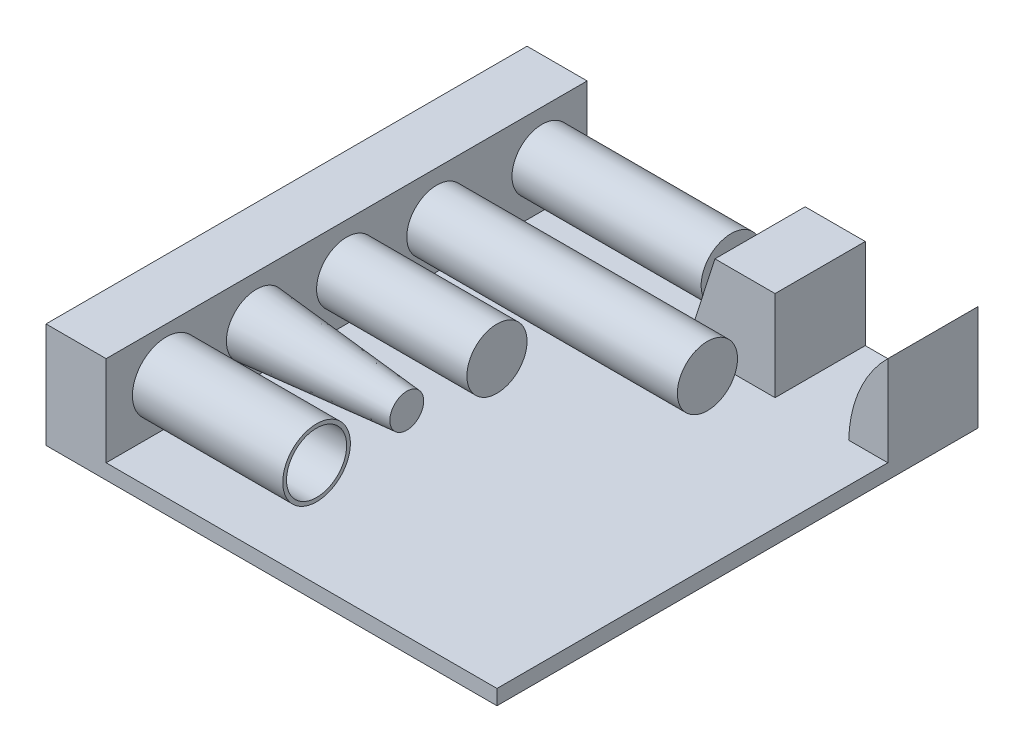
ISO-10303-21;
HEADER;
FILE_DESCRIPTION(('STEP AP214'),'2;1');
FILE_NAME('part.step','',(''),(''),'','','');
FILE_SCHEMA(('AUTOMOTIVE_DESIGN { 1 0 10303 214 1 1 1 1 }'));
ENDSEC;
DATA;
#1=APPLICATION_CONTEXT('core data for automotive mechanical design processes');
#2=APPLICATION_PROTOCOL_DEFINITION('international standard','automotive_design',2000,#1);
#3=PRODUCT_CONTEXT('',#1,'mechanical');
#4=PRODUCT('Part','Part','',(#3));
#5=PRODUCT_RELATED_PRODUCT_CATEGORY('part','',(#4));
#6=PRODUCT_DEFINITION_FORMATION('','',#4);
#7=PRODUCT_DEFINITION_CONTEXT('part definition',#1,'design');
#8=PRODUCT_DEFINITION('design','',#6,#7);
#9=PRODUCT_DEFINITION_SHAPE('','',#8);
#10=(LENGTH_UNIT() NAMED_UNIT(*) SI_UNIT(.MILLI.,.METRE.));
#11=(NAMED_UNIT(*) PLANE_ANGLE_UNIT() SI_UNIT($,.RADIAN.));
#12=(NAMED_UNIT(*) SI_UNIT($,.STERADIAN.) SOLID_ANGLE_UNIT());
#13=UNCERTAINTY_MEASURE_WITH_UNIT(LENGTH_MEASURE(1.E-05),#10,'distance_accuracy_value','');
#14=(GEOMETRIC_REPRESENTATION_CONTEXT(3) GLOBAL_UNCERTAINTY_ASSIGNED_CONTEXT((#13)) GLOBAL_UNIT_ASSIGNED_CONTEXT((#10,
#11,#12)) REPRESENTATION_CONTEXT('',''));
#15=CARTESIAN_POINT('',(0.,0.,0.));
#16=DIRECTION('',(0.,0.,1.));
#17=DIRECTION('',(1.,0.,0.));
#18=AXIS2_PLACEMENT_3D('',#15,#16,#17);
#19=CARTESIAN_POINT('',(-220.,20.,640.));
#20=DIRECTION('',(0.,-1.,0.));
#21=DIRECTION('',(0.,0.,-1.));
#22=AXIS2_PLACEMENT_3D('',#19,#20,#21);
#23=PLANE('',#22);
#24=DIRECTION('',(0.,0.,-1.));
#25=VECTOR('',#24,1.);
#26=CARTESIAN_POINT('',(31.6,20.,120.));
#27=LINE('',#26,#25);
#28=CARTESIAN_POINT('',(31.6,20.,120.));
#29=VERTEX_POINT('',#28);
#30=CARTESIAN_POINT('',(31.6,20.,0.));
#31=VERTEX_POINT('',#30);
#32=EDGE_CURVE('E174',#29,#31,#27,.T.);
#33=ORIENTED_EDGE('',*,*,#32,.T.);
#34=DIRECTION('',(-1.,0.,0.));
#35=VECTOR('',#34,1.);
#36=CARTESIAN_POINT('',(-220.,20.,0.));
#37=LINE('',#36,#35);
#38=CARTESIAN_POINT('',(-220.,20.,0.));
#39=VERTEX_POINT('',#38);
#40=EDGE_CURVE('E231',#31,#39,#37,.T.);
#41=ORIENTED_EDGE('',*,*,#40,.T.);
#42=DIRECTION('',(0.,0.,-1.));
#43=VECTOR('',#42,1.);
#44=CARTESIAN_POINT('',(-220.,20.,640.));
#45=LINE('',#44,#43);
#46=CARTESIAN_POINT('',(-220.,20.,640.));
#47=VERTEX_POINT('',#46);
#48=EDGE_CURVE('E247',#47,#39,#45,.T.);
#49=ORIENTED_EDGE('',*,*,#48,.F.);
#50=DIRECTION('',(-1.,0.,0.));
#51=VECTOR('',#50,1.);
#52=CARTESIAN_POINT('',(-220.,20.,640.));
#53=LINE('',#52,#51);
#54=CARTESIAN_POINT('',(300.,20.,640.));
#55=VERTEX_POINT('',#54);
#56=EDGE_CURVE('E212',#55,#47,#53,.T.);
#57=ORIENTED_EDGE('',*,*,#56,.F.);
#58=DIRECTION('',(0.,0.,-1.));
#59=VECTOR('',#58,1.);
#60=CARTESIAN_POINT('',(300.,20.,640.));
#61=LINE('',#60,#59);
#62=CARTESIAN_POINT('',(300.,20.,120.));
#63=VERTEX_POINT('',#62);
#64=EDGE_CURVE('E251',#55,#63,#61,.T.);
#65=ORIENTED_EDGE('',*,*,#64,.T.);
#66=DIRECTION('',(1.,0.,0.));
#67=VECTOR('',#66,1.);
#68=CARTESIAN_POINT('',(300.,20.,120.));
#69=LINE('',#68,#67);
#70=CARTESIAN_POINT('',(247.956312481218,20.,120.));
#71=VERTEX_POINT('',#70);
#72=EDGE_CURVE('E178',#71,#63,#69,.T.);
#73=ORIENTED_EDGE('',*,*,#72,.F.);
#74=DIRECTION('',(0.,0.,-1.));
#75=VECTOR('',#74,1.);
#76=CARTESIAN_POINT('',(247.956312481219,20.,120.));
#77=LINE('',#76,#75);
#78=CARTESIAN_POINT('',(247.956312481219,20.,0.));
#79=VERTEX_POINT('',#78);
#80=EDGE_CURVE('E189',#71,#79,#77,.T.);
#81=ORIENTED_EDGE('',*,*,#80,.T.);
#82=CARTESIAN_POINT('',(150.,20.,0.));
#83=VERTEX_POINT('',#82);
#84=EDGE_CURVE('E232',#79,#83,#37,.T.);
#85=ORIENTED_EDGE('',*,*,#84,.T.);
#86=DIRECTION('',(0.,0.,-1.));
#87=VECTOR('',#86,1.);
#88=CARTESIAN_POINT('',(150.,20.,120.));
#89=LINE('',#88,#87);
#90=CARTESIAN_POINT('',(150.,20.,120.));
#91=VERTEX_POINT('',#90);
#92=EDGE_CURVE('E66',#91,#83,#89,.T.);
#93=ORIENTED_EDGE('',*,*,#92,.F.);
#94=DIRECTION('',(1.,0.,0.));
#95=VECTOR('',#94,1.);
#96=CARTESIAN_POINT('',(150.,20.,120.));
#97=LINE('',#96,#95);
#98=EDGE_CURVE('E61',#29,#91,#97,.T.);
#99=ORIENTED_EDGE('',*,*,#98,.F.);
#100=EDGE_LOOP('',(#33,#41,#49,#57,#65,#73,#81,#85,#93,#99));
#101=FACE_BOUND('',#100,.T.);
#102=ADVANCED_FACE('F45',(#101),#23,.F.);
#103=CARTESIAN_POINT('',(-300.,0.,640.));
#104=DIRECTION('',(1.,0.,0.));
#105=DIRECTION('',(0.,0.,-1.));
#106=AXIS2_PLACEMENT_3D('',#103,#104,#105);
#107=PLANE('',#106);
#108=DIRECTION('',(0.,-1.,0.));
#109=VECTOR('',#108,1.);
#110=CARTESIAN_POINT('',(-300.,0.,0.));
#111=LINE('',#110,#109);
#112=CARTESIAN_POINT('',(-300.,140.,0.));
#113=VERTEX_POINT('',#112);
#114=CARTESIAN_POINT('',(-300.,0.,0.));
#115=VERTEX_POINT('',#114);
#116=EDGE_CURVE('E200',#113,#115,#111,.T.);
#117=ORIENTED_EDGE('',*,*,#116,.T.);
#118=DIRECTION('',(0.,0.,-1.));
#119=VECTOR('',#118,1.);
#120=CARTESIAN_POINT('',(-300.,0.,640.));
#121=LINE('',#120,#119);
#122=CARTESIAN_POINT('',(-300.,0.,640.));
#123=VERTEX_POINT('',#122);
#124=EDGE_CURVE('E258',#123,#115,#121,.T.);
#125=ORIENTED_EDGE('',*,*,#124,.F.);
#126=DIRECTION('',(0.,-1.,0.));
#127=VECTOR('',#126,1.);
#128=CARTESIAN_POINT('',(-300.,0.,640.));
#129=LINE('',#128,#127);
#130=CARTESIAN_POINT('',(-300.,140.,640.));
#131=VERTEX_POINT('',#130);
#132=EDGE_CURVE('E201',#131,#123,#129,.T.);
#133=ORIENTED_EDGE('',*,*,#132,.F.);
#134=DIRECTION('',(0.,0.,-1.));
#135=VECTOR('',#134,1.);
#136=CARTESIAN_POINT('',(-300.,140.,640.));
#137=LINE('',#136,#135);
#138=EDGE_CURVE('E221',#131,#113,#137,.T.);
#139=ORIENTED_EDGE('',*,*,#138,.T.);
#140=EDGE_LOOP('',(#117,#125,#133,#139));
#141=FACE_BOUND('',#140,.T.);
#142=ADVANCED_FACE('F47',(#141),#107,.F.);
#143=CARTESIAN_POINT('',(-300.,0.,640.));
#144=DIRECTION('',(0.,1.,0.));
#145=DIRECTION('',(0.,0.,1.));
#146=AXIS2_PLACEMENT_3D('',#143,#144,#145);
#147=PLANE('',#146);
#148=DIRECTION('',(1.,0.,0.));
#149=VECTOR('',#148,1.);
#150=CARTESIAN_POINT('',(-300.,0.,0.));
#151=LINE('',#150,#149);
#152=CARTESIAN_POINT('',(300.,0.,0.));
#153=VERTEX_POINT('',#152);
#154=EDGE_CURVE('E225',#115,#153,#151,.T.);
#155=ORIENTED_EDGE('',*,*,#154,.T.);
#156=DIRECTION('',(0.,0.,-1.));
#157=VECTOR('',#156,1.);
#158=CARTESIAN_POINT('',(300.,0.,640.));
#159=LINE('',#158,#157);
#160=CARTESIAN_POINT('',(300.,0.,640.));
#161=VERTEX_POINT('',#160);
#162=EDGE_CURVE('E254',#161,#153,#159,.T.);
#163=ORIENTED_EDGE('',*,*,#162,.F.);
#164=DIRECTION('',(1.,0.,0.));
#165=VECTOR('',#164,1.);
#166=CARTESIAN_POINT('',(-300.,0.,640.));
#167=LINE('',#166,#165);
#168=EDGE_CURVE('E205',#123,#161,#167,.T.);
#169=ORIENTED_EDGE('',*,*,#168,.F.);
#170=ORIENTED_EDGE('',*,*,#124,.T.);
#171=EDGE_LOOP('',(#155,#163,#169,#170));
#172=FACE_BOUND('',#171,.T.);
#173=ADVANCED_FACE('F374',(#172),#147,.F.);
#174=CARTESIAN_POINT('',(300.,20.,640.));
#175=DIRECTION('',(-1.,0.,0.));
#176=DIRECTION('',(0.,0.,1.));
#177=AXIS2_PLACEMENT_3D('',#174,#175,#176);
#178=PLANE('',#177);
#179=DIRECTION('',(0.,1.,0.));
#180=VECTOR('',#179,1.);
#181=CARTESIAN_POINT('',(300.,20.,0.));
#182=LINE('',#181,#180);
#183=CARTESIAN_POINT('',(300.,140.,0.));
#184=VERTEX_POINT('',#183);
#185=EDGE_CURVE('E228',#153,#184,#182,.T.);
#186=ORIENTED_EDGE('',*,*,#185,.T.);
#187=DIRECTION('',(0.,0.,-1.));
#188=VECTOR('',#187,1.);
#189=CARTESIAN_POINT('',(300.,140.,120.));
#190=LINE('',#189,#188);
#191=CARTESIAN_POINT('',(300.,140.,120.));
#192=VERTEX_POINT('',#191);
#193=EDGE_CURVE('E196',#192,#184,#190,.T.);
#194=ORIENTED_EDGE('',*,*,#193,.F.);
#195=DIRECTION('',(0.,1.,0.));
#196=VECTOR('',#195,1.);
#197=CARTESIAN_POINT('',(300.,140.,120.));
#198=LINE('',#197,#196);
#199=EDGE_CURVE('E182',#63,#192,#198,.T.);
#200=ORIENTED_EDGE('',*,*,#199,.F.);
#201=ORIENTED_EDGE('',*,*,#64,.F.);
#202=DIRECTION('',(0.,1.,0.));
#203=VECTOR('',#202,1.);
#204=CARTESIAN_POINT('',(300.,20.,640.));
#205=LINE('',#204,#203);
#206=EDGE_CURVE('E209',#161,#55,#205,.T.);
#207=ORIENTED_EDGE('',*,*,#206,.F.);
#208=ORIENTED_EDGE('',*,*,#162,.T.);
#209=EDGE_LOOP('',(#186,#194,#200,#201,#207,#208));
#210=FACE_BOUND('',#209,.T.);
#211=ADVANCED_FACE('F279',(#210),#178,.F.);
#212=CARTESIAN_POINT('',(-220.,140.,640.));
#213=DIRECTION('',(-1.,0.,0.));
#214=DIRECTION('',(0.,0.,1.));
#215=AXIS2_PLACEMENT_3D('',#212,#213,#214);
#216=PLANE('',#215);
#217=CARTESIAN_POINT('',(-220.,80.,560.));
#218=DIRECTION('',(-1.,0.,0.));
#219=DIRECTION('',(0.,0.,1.));
#220=AXIS2_PLACEMENT_3D('',#217,#218,#219);
#221=CIRCLE('',#220,45.);
#222=CARTESIAN_POINT('',(-220.,80.,605.));
#223=VERTEX_POINT('',#222);
#224=EDGE_CURVE('E12',#223,#223,#221,.F.);
#225=ORIENTED_EDGE('',*,*,#224,.F.);
#226=EDGE_LOOP('',(#225));
#227=FACE_BOUND('',#226,.T.);
#228=CARTESIAN_POINT('',(-220.,80.,440.));
#229=DIRECTION('',(-1.,0.,0.));
#230=DIRECTION('',(0.,0.,1.));
#231=AXIS2_PLACEMENT_3D('',#228,#229,#230);
#232=CIRCLE('',#231,40.);
#233=CARTESIAN_POINT('',(-220.,80.,480.));
#234=VERTEX_POINT('',#233);
#235=EDGE_CURVE('E54',#234,#234,#232,.F.);
#236=ORIENTED_EDGE('',*,*,#235,.F.);
#237=EDGE_LOOP('',(#236));
#238=FACE_BOUND('',#237,.T.);
#239=CARTESIAN_POINT('',(-220.,80.,320.));
#240=DIRECTION('',(-1.,0.,0.));
#241=DIRECTION('',(0.,0.,1.));
#242=AXIS2_PLACEMENT_3D('',#239,#240,#241);
#243=CIRCLE('',#242,40.);
#244=CARTESIAN_POINT('',(-220.,80.,360.));
#245=VERTEX_POINT('',#244);
#246=EDGE_CURVE('E266',#245,#245,#243,.F.);
#247=ORIENTED_EDGE('',*,*,#246,.F.);
#248=EDGE_LOOP('',(#247));
#249=FACE_BOUND('',#248,.T.);
#250=CARTESIAN_POINT('',(-220.,80.,200.));
#251=DIRECTION('',(-1.,0.,0.));
#252=DIRECTION('',(0.,0.,1.));
#253=AXIS2_PLACEMENT_3D('',#250,#251,#252);
#254=CIRCLE('',#253,40.);
#255=CARTESIAN_POINT('',(-220.,80.,240.));
#256=VERTEX_POINT('',#255);
#257=EDGE_CURVE('E288',#256,#256,#254,.F.);
#258=ORIENTED_EDGE('',*,*,#257,.F.);
#259=EDGE_LOOP('',(#258));
#260=FACE_BOUND('',#259,.T.);
#261=CARTESIAN_POINT('',(-220.,80.,60.));
#262=DIRECTION('',(-1.,0.,0.));
#263=DIRECTION('',(0.,0.,1.));
#264=AXIS2_PLACEMENT_3D('',#261,#262,#263);
#265=CIRCLE('',#264,40.);
#266=CARTESIAN_POINT('',(-220.,80.,100.));
#267=VERTEX_POINT('',#266);
#268=EDGE_CURVE('E262',#267,#267,#265,.F.);
#269=ORIENTED_EDGE('',*,*,#268,.F.);
#270=EDGE_LOOP('',(#269));
#271=FACE_BOUND('',#270,.T.);
#272=DIRECTION('',(0.,1.,0.));
#273=VECTOR('',#272,1.);
#274=CARTESIAN_POINT('',(-220.,140.,0.));
#275=LINE('',#274,#273);
#276=CARTESIAN_POINT('',(-220.,140.,0.));
#277=VERTEX_POINT('',#276);
#278=EDGE_CURVE('E235',#39,#277,#275,.T.);
#279=ORIENTED_EDGE('',*,*,#278,.T.);
#280=DIRECTION('',(0.,0.,-1.));
#281=VECTOR('',#280,1.);
#282=CARTESIAN_POINT('',(-220.,140.,640.));
#283=LINE('',#282,#281);
#284=CARTESIAN_POINT('',(-220.,140.,640.));
#285=VERTEX_POINT('',#284);
#286=EDGE_CURVE('E243',#285,#277,#283,.T.);
#287=ORIENTED_EDGE('',*,*,#286,.F.);
#288=DIRECTION('',(0.,1.,0.));
#289=VECTOR('',#288,1.);
#290=CARTESIAN_POINT('',(-220.,140.,640.));
#291=LINE('',#290,#289);
#292=EDGE_CURVE('E215',#47,#285,#291,.T.);
#293=ORIENTED_EDGE('',*,*,#292,.F.);
#294=ORIENTED_EDGE('',*,*,#48,.T.);
#295=EDGE_LOOP('',(#279,#287,#293,#294));
#296=FACE_BOUND('',#295,.T.);
#297=ADVANCED_FACE('F275',(#227,#238,#249,#260,#271,#296),#216,.F.);
#298=CARTESIAN_POINT('',(-300.,140.,640.));
#299=DIRECTION('',(0.,-1.,0.));
#300=DIRECTION('',(0.,0.,-1.));
#301=AXIS2_PLACEMENT_3D('',#298,#299,#300);
#302=PLANE('',#301);
#303=DIRECTION('',(-1.,0.,0.));
#304=VECTOR('',#303,1.);
#305=CARTESIAN_POINT('',(-300.,140.,0.));
#306=LINE('',#305,#304);
#307=EDGE_CURVE('E206',#277,#113,#306,.T.);
#308=ORIENTED_EDGE('',*,*,#307,.T.);
#309=ORIENTED_EDGE('',*,*,#138,.F.);
#310=DIRECTION('',(-1.,0.,0.));
#311=VECTOR('',#310,1.);
#312=CARTESIAN_POINT('',(-300.,140.,640.));
#313=LINE('',#312,#311);
#314=EDGE_CURVE('E218',#285,#131,#313,.T.);
#315=ORIENTED_EDGE('',*,*,#314,.F.);
#316=ORIENTED_EDGE('',*,*,#286,.T.);
#317=EDGE_LOOP('',(#308,#309,#315,#316));
#318=FACE_BOUND('',#317,.T.);
#319=ADVANCED_FACE('F278',(#318),#302,.F.);
#320=CARTESIAN_POINT('',(0.,0.,640.));
#321=DIRECTION('',(0.,0.,-1.));
#322=DIRECTION('',(-1.,0.,0.));
#323=AXIS2_PLACEMENT_3D('',#320,#321,#322);
#324=PLANE('',#323);
#325=ORIENTED_EDGE('',*,*,#132,.T.);
#326=ORIENTED_EDGE('',*,*,#168,.T.);
#327=ORIENTED_EDGE('',*,*,#206,.T.);
#328=ORIENTED_EDGE('',*,*,#56,.T.);
#329=ORIENTED_EDGE('',*,*,#292,.T.);
#330=ORIENTED_EDGE('',*,*,#314,.T.);
#331=EDGE_LOOP('',(#325,#326,#327,#328,#329,#330));
#332=FACE_BOUND('',#331,.T.);
#333=ADVANCED_FACE('F307',(#332),#324,.F.);
#334=CARTESIAN_POINT('',(0.,0.,0.));
#335=DIRECTION('',(0.,0.,-1.));
#336=DIRECTION('',(-1.,0.,0.));
#337=AXIS2_PLACEMENT_3D('',#334,#335,#336);
#338=PLANE('',#337);
#339=ORIENTED_EDGE('',*,*,#116,.F.);
#340=ORIENTED_EDGE('',*,*,#307,.F.);
#341=ORIENTED_EDGE('',*,*,#278,.F.);
#342=ORIENTED_EDGE('',*,*,#40,.F.);
#343=DIRECTION('',(-0.304775727103784,-0.952424147199324,0.));
#344=VECTOR('',#343,1.);
#345=CARTESIAN_POINT('',(31.6,20.,0.));
#346=LINE('',#345,#344);
#347=CARTESIAN_POINT('',(70.,140.,0.));
#348=VERTEX_POINT('',#347);
#349=EDGE_CURVE('E161',#348,#31,#346,.T.);
#350=ORIENTED_EDGE('',*,*,#349,.F.);
#351=DIRECTION('',(-1.,0.,0.));
#352=VECTOR('',#351,1.);
#353=CARTESIAN_POINT('',(150.,140.,0.));
#354=LINE('',#353,#352);
#355=CARTESIAN_POINT('',(150.,140.,0.));
#356=VERTEX_POINT('',#355);
#357=EDGE_CURVE('E168',#356,#348,#354,.T.);
#358=ORIENTED_EDGE('',*,*,#357,.F.);
#359=DIRECTION('',(0.,1.,0.));
#360=VECTOR('',#359,1.);
#361=CARTESIAN_POINT('',(150.,140.,0.));
#362=LINE('',#361,#360);
#363=EDGE_CURVE('E146',#83,#356,#362,.T.);
#364=ORIENTED_EDGE('',*,*,#363,.F.);
#365=ORIENTED_EDGE('',*,*,#84,.F.);
#366=CARTESIAN_POINT('',(423.85224033938,15.,0.));
#367=DIRECTION('',(0.,0.,1.));
#368=DIRECTION('',(1.,0.,0.));
#369=AXIS2_PLACEMENT_3D('',#366,#367,#368);
#370=CIRCLE('',#369,175.966978257523);
#371=EDGE_CURVE('E177',#184,#79,#370,.T.);
#372=ORIENTED_EDGE('',*,*,#371,.F.);
#373=ORIENTED_EDGE('',*,*,#185,.F.);
#374=ORIENTED_EDGE('',*,*,#154,.F.);
#375=EDGE_LOOP('',(#339,#340,#341,#342,#350,#358,#364,#365,#372,#373,#374));
#376=FACE_BOUND('',#375,.T.);
#377=ADVANCED_FACE('F301',(#376),#338,.T.);
#378=CARTESIAN_POINT('',(423.85224033938,15.,120.));
#379=DIRECTION('',(0.,0.,-1.));
#380=DIRECTION('',(-1.,0.,0.));
#381=AXIS2_PLACEMENT_3D('',#378,#379,#380);
#382=CYLINDRICAL_SURFACE('',#381,175.966978257523);
#383=ORIENTED_EDGE('',*,*,#371,.T.);
#384=ORIENTED_EDGE('',*,*,#80,.F.);
#385=CARTESIAN_POINT('',(423.85224033938,15.,120.));
#386=DIRECTION('',(0.,0.,1.));
#387=DIRECTION('',(1.,0.,0.));
#388=AXIS2_PLACEMENT_3D('',#385,#386,#387);
#389=CIRCLE('',#388,175.966978257523);
#390=EDGE_CURVE('E185',#192,#71,#389,.T.);
#391=ORIENTED_EDGE('',*,*,#390,.F.);
#392=ORIENTED_EDGE('',*,*,#193,.T.);
#393=EDGE_LOOP('',(#383,#384,#391,#392));
#394=FACE_BOUND('',#393,.T.);
#395=ADVANCED_FACE('F387',(#394),#382,.T.);
#396=CARTESIAN_POINT('',(423.85224033938,15.,120.));
#397=DIRECTION('',(0.,0.,1.));
#398=DIRECTION('',(1.,0.,0.));
#399=AXIS2_PLACEMENT_3D('',#396,#397,#398);
#400=PLANE('',#399);
#401=ORIENTED_EDGE('',*,*,#72,.T.);
#402=ORIENTED_EDGE('',*,*,#199,.T.);
#403=ORIENTED_EDGE('',*,*,#390,.T.);
#404=EDGE_LOOP('',(#401,#402,#403));
#405=FACE_BOUND('',#404,.T.);
#406=ADVANCED_FACE('F391',(#405),#400,.T.);
#407=CARTESIAN_POINT('',(31.6,20.,120.));
#408=DIRECTION('',(0.952424147199324,-0.304775727103784,0.));
#409=DIRECTION('',(0.304775727103784,0.952424147199324,0.));
#410=AXIS2_PLACEMENT_3D('',#407,#408,#409);
#411=PLANE('',#410);
#412=ORIENTED_EDGE('',*,*,#349,.T.);
#413=ORIENTED_EDGE('',*,*,#32,.F.);
#414=DIRECTION('',(-0.304775727103784,-0.952424147199324,0.));
#415=VECTOR('',#414,1.);
#416=CARTESIAN_POINT('',(31.6,20.,120.));
#417=LINE('',#416,#415);
#418=CARTESIAN_POINT('',(70.,140.,120.));
#419=VERTEX_POINT('',#418);
#420=EDGE_CURVE('E170',#419,#29,#417,.T.);
#421=ORIENTED_EDGE('',*,*,#420,.F.);
#422=DIRECTION('',(0.,0.,-1.));
#423=VECTOR('',#422,1.);
#424=CARTESIAN_POINT('',(70.,140.,120.));
#425=LINE('',#424,#423);
#426=EDGE_CURVE('E150',#419,#348,#425,.T.);
#427=ORIENTED_EDGE('',*,*,#426,.T.);
#428=EDGE_LOOP('',(#412,#413,#421,#427));
#429=FACE_BOUND('',#428,.T.);
#430=ADVANCED_FACE('F316',(#429),#411,.F.);
#431=CARTESIAN_POINT('',(150.,140.,120.));
#432=DIRECTION('',(-1.,0.,0.));
#433=DIRECTION('',(0.,-1.,0.));
#434=AXIS2_PLACEMENT_3D('',#431,#432,#433);
#435=PLANE('',#434);
#436=ORIENTED_EDGE('',*,*,#363,.T.);
#437=DIRECTION('',(0.,0.,-1.));
#438=VECTOR('',#437,1.);
#439=CARTESIAN_POINT('',(150.,140.,120.));
#440=LINE('',#439,#438);
#441=CARTESIAN_POINT('',(150.,140.,120.));
#442=VERTEX_POINT('',#441);
#443=EDGE_CURVE('E143',#442,#356,#440,.T.);
#444=ORIENTED_EDGE('',*,*,#443,.F.);
#445=DIRECTION('',(0.,1.,0.));
#446=VECTOR('',#445,1.);
#447=CARTESIAN_POINT('',(150.,140.,120.));
#448=LINE('',#447,#446);
#449=EDGE_CURVE('E133',#91,#442,#448,.T.);
#450=ORIENTED_EDGE('',*,*,#449,.F.);
#451=ORIENTED_EDGE('',*,*,#92,.T.);
#452=EDGE_LOOP('',(#436,#444,#450,#451));
#453=FACE_BOUND('',#452,.T.);
#454=ADVANCED_FACE('F144',(#453),#435,.F.);
#455=CARTESIAN_POINT('',(150.,140.,120.));
#456=DIRECTION('',(0.,-1.,0.));
#457=DIRECTION('',(1.,0.,0.));
#458=AXIS2_PLACEMENT_3D('',#455,#456,#457);
#459=PLANE('',#458);
#460=ORIENTED_EDGE('',*,*,#357,.T.);
#461=ORIENTED_EDGE('',*,*,#426,.F.);
#462=DIRECTION('',(-1.,0.,0.));
#463=VECTOR('',#462,1.);
#464=CARTESIAN_POINT('',(150.,140.,120.));
#465=LINE('',#464,#463);
#466=EDGE_CURVE('E137',#442,#419,#465,.T.);
#467=ORIENTED_EDGE('',*,*,#466,.F.);
#468=ORIENTED_EDGE('',*,*,#443,.T.);
#469=EDGE_LOOP('',(#460,#461,#467,#468));
#470=FACE_BOUND('',#469,.T.);
#471=ADVANCED_FACE('F152',(#470),#459,.F.);
#472=CARTESIAN_POINT('',(0.,0.,120.));
#473=DIRECTION('',(0.,0.,1.));
#474=DIRECTION('',(1.,0.,0.));
#475=AXIS2_PLACEMENT_3D('',#472,#473,#474);
#476=PLANE('',#475);
#477=ORIENTED_EDGE('',*,*,#420,.T.);
#478=ORIENTED_EDGE('',*,*,#98,.T.);
#479=ORIENTED_EDGE('',*,*,#449,.T.);
#480=ORIENTED_EDGE('',*,*,#466,.T.);
#481=EDGE_LOOP('',(#477,#478,#479,#480));
#482=FACE_BOUND('',#481,.T.);
#483=ADVANCED_FACE('F135',(#482),#476,.T.);
#484=CARTESIAN_POINT('',(31.6,80.,60.));
#485=DIRECTION('',(-1.,0.,0.));
#486=DIRECTION('',(0.,0.,1.));
#487=AXIS2_PLACEMENT_3D('',#484,#485,#486);
#488=CYLINDRICAL_SURFACE('',#487,40.);
#489=CARTESIAN_POINT('',(31.6,80.,60.));
#490=DIRECTION('',(1.,0.,0.));
#491=DIRECTION('',(0.,0.,-1.));
#492=AXIS2_PLACEMENT_3D('',#489,#490,#491);
#493=CIRCLE('',#492,40.);
#494=CARTESIAN_POINT('',(31.6,80.,20.));
#495=VERTEX_POINT('',#494);
#496=EDGE_CURVE('E165',#495,#495,#493,.T.);
#497=ORIENTED_EDGE('',*,*,#496,.F.);
#498=EDGE_LOOP('',(#497));
#499=FACE_BOUND('',#498,.T.);
#500=ORIENTED_EDGE('',*,*,#268,.T.);
#501=EDGE_LOOP('',(#500));
#502=FACE_BOUND('',#501,.T.);
#503=ADVANCED_FACE('F458',(#499,#502),#488,.T.);
#504=CARTESIAN_POINT('',(31.6,80.,60.));
#505=DIRECTION('',(1.,0.,0.));
#506=DIRECTION('',(0.,0.,-1.));
#507=AXIS2_PLACEMENT_3D('',#504,#505,#506);
#508=PLANE('',#507);
#509=ORIENTED_EDGE('',*,*,#496,.T.);
#510=EDGE_LOOP('',(#509));
#511=FACE_BOUND('',#510,.T.);
#512=ADVANCED_FACE('F467',(#511),#508,.T.);
#513=CARTESIAN_POINT('',(-300.002,80.,200.));
#514=DIRECTION('',(1.,0.,0.));
#515=DIRECTION('',(0.,0.,-1.));
#516=AXIS2_PLACEMENT_3D('',#513,#514,#515);
#517=CYLINDRICAL_SURFACE('',#516,40.);
#518=ORIENTED_EDGE('',*,*,#257,.T.);
#519=EDGE_LOOP('',(#518));
#520=FACE_BOUND('',#519,.T.);
#521=CARTESIAN_POINT('',(140.,80.,200.));
#522=DIRECTION('',(1.,0.,0.));
#523=DIRECTION('',(0.,0.,-1.));
#524=AXIS2_PLACEMENT_3D('',#521,#522,#523);
#525=CIRCLE('',#524,40.);
#526=CARTESIAN_POINT('',(140.,80.,160.));
#527=VERTEX_POINT('',#526);
#528=EDGE_CURVE('E326',#527,#527,#525,.T.);
#529=ORIENTED_EDGE('',*,*,#528,.F.);
#530=EDGE_LOOP('',(#529));
#531=FACE_BOUND('',#530,.T.);
#532=ADVANCED_FACE('F477',(#520,#531),#517,.T.);
#533=CARTESIAN_POINT('',(140.,80.,200.));
#534=DIRECTION('',(1.,0.,0.));
#535=DIRECTION('',(0.,0.,-1.));
#536=AXIS2_PLACEMENT_3D('',#533,#534,#535);
#537=PLANE('',#536);
#538=ORIENTED_EDGE('',*,*,#528,.T.);
#539=EDGE_LOOP('',(#538));
#540=FACE_BOUND('',#539,.T.);
#541=ADVANCED_FACE('F487',(#540),#537,.T.);
#542=CARTESIAN_POINT('',(-20.,80.,320.));
#543=DIRECTION('',(-1.,0.,0.));
#544=DIRECTION('',(0.,0.,1.));
#545=AXIS2_PLACEMENT_3D('',#542,#543,#544);
#546=CYLINDRICAL_SURFACE('',#545,40.);
#547=CARTESIAN_POINT('',(-20.,80.,320.));
#548=DIRECTION('',(1.,0.,0.));
#549=DIRECTION('',(0.,0.,-1.));
#550=AXIS2_PLACEMENT_3D('',#547,#548,#549);
#551=CIRCLE('',#550,40.);
#552=CARTESIAN_POINT('',(-20.,80.,280.));
#553=VERTEX_POINT('',#552);
#554=EDGE_CURVE('E330',#553,#553,#551,.T.);
#555=ORIENTED_EDGE('',*,*,#554,.F.);
#556=EDGE_LOOP('',(#555));
#557=FACE_BOUND('',#556,.T.);
#558=ORIENTED_EDGE('',*,*,#246,.T.);
#559=EDGE_LOOP('',(#558));
#560=FACE_BOUND('',#559,.T.);
#561=ADVANCED_FACE('F497',(#557,#560),#546,.T.);
#562=CARTESIAN_POINT('',(-20.,80.,320.));
#563=DIRECTION('',(1.,0.,0.));
#564=DIRECTION('',(0.,0.,-1.));
#565=AXIS2_PLACEMENT_3D('',#562,#563,#564);
#566=PLANE('',#565);
#567=ORIENTED_EDGE('',*,*,#554,.T.);
#568=EDGE_LOOP('',(#567));
#569=FACE_BOUND('',#568,.T.);
#570=ADVANCED_FACE('F507',(#569),#566,.T.);
#571=CARTESIAN_POINT('',(-220.,80.,440.));
#572=DIRECTION('',(-1.,0.,0.));
#573=DIRECTION('',(0.,0.,-1.));
#574=AXIS2_PLACEMENT_3D('',#571,#572,#573);
#575=CONICAL_SURFACE('',#574,40.,0.0872664625997167);
#576=CARTESIAN_POINT('',(-20.,80.,440.));
#577=DIRECTION('',(1.,0.,0.));
#578=DIRECTION('',(0.,0.,-1.));
#579=AXIS2_PLACEMENT_3D('',#576,#577,#578);
#580=CIRCLE('',#579,22.5022672948151);
#581=CARTESIAN_POINT('',(-20.,80.,417.497732705185));
#582=VERTEX_POINT('',#581);
#583=EDGE_CURVE('E334',#582,#582,#580,.T.);
#584=ORIENTED_EDGE('',*,*,#583,.F.);
#585=EDGE_LOOP('',(#584));
#586=FACE_BOUND('',#585,.T.);
#587=ORIENTED_EDGE('',*,*,#235,.T.);
#588=EDGE_LOOP('',(#587));
#589=FACE_BOUND('',#588,.T.);
#590=ADVANCED_FACE('F273',(#586,#589),#575,.T.);
#591=CARTESIAN_POINT('',(-20.,80.,440.));
#592=DIRECTION('',(1.,0.,0.));
#593=DIRECTION('',(0.,0.,-1.));
#594=AXIS2_PLACEMENT_3D('',#591,#592,#593);
#595=PLANE('',#594);
#596=ORIENTED_EDGE('',*,*,#583,.T.);
#597=EDGE_LOOP('',(#596));
#598=FACE_BOUND('',#597,.T.);
#599=ADVANCED_FACE('F357',(#598),#595,.T.);
#600=CARTESIAN_POINT('',(-20.,80.,560.));
#601=DIRECTION('',(1.,0.,0.));
#602=DIRECTION('',(0.,0.,-1.));
#603=AXIS2_PLACEMENT_3D('',#600,#601,#602);
#604=PLANE('',#603);
#605=CARTESIAN_POINT('',(-20.,80.,560.));
#606=DIRECTION('',(1.,0.,0.));
#607=DIRECTION('',(0.,0.,-1.));
#608=AXIS2_PLACEMENT_3D('',#605,#606,#607);
#609=CIRCLE('',#608,45.);
#610=CARTESIAN_POINT('',(-20.,80.,515.));
#611=VERTEX_POINT('',#610);
#612=EDGE_CURVE('E338',#611,#611,#609,.T.);
#613=ORIENTED_EDGE('',*,*,#612,.T.);
#614=EDGE_LOOP('',(#613));
#615=FACE_BOUND('',#614,.T.);
#616=CARTESIAN_POINT('',(-20.,80.,560.));
#617=DIRECTION('',(1.,0.,0.));
#618=DIRECTION('',(0.,0.,-1.));
#619=AXIS2_PLACEMENT_3D('',#616,#617,#618);
#620=CIRCLE('',#619,40.);
#621=CARTESIAN_POINT('',(-20.,80.,520.));
#622=VERTEX_POINT('',#621);
#623=EDGE_CURVE('E342',#622,#622,#620,.T.);
#624=ORIENTED_EDGE('',*,*,#623,.F.);
#625=EDGE_LOOP('',(#624));
#626=FACE_BOUND('',#625,.T.);
#627=ADVANCED_FACE('F354',(#615,#626),#604,.T.);
#628=CARTESIAN_POINT('',(-20.,80.,560.));
#629=DIRECTION('',(-1.,0.,0.));
#630=DIRECTION('',(0.,0.,1.));
#631=AXIS2_PLACEMENT_3D('',#628,#629,#630);
#632=CYLINDRICAL_SURFACE('',#631,45.);
#633=ORIENTED_EDGE('',*,*,#612,.F.);
#634=EDGE_LOOP('',(#633));
#635=FACE_BOUND('',#634,.T.);
#636=ORIENTED_EDGE('',*,*,#224,.T.);
#637=EDGE_LOOP('',(#636));
#638=FACE_BOUND('',#637,.T.);
#639=ADVANCED_FACE('F356',(#635,#638),#632,.T.);
#640=CARTESIAN_POINT('',(-20.,80.,560.));
#641=DIRECTION('',(-1.,0.,0.));
#642=DIRECTION('',(0.,0.,1.));
#643=AXIS2_PLACEMENT_3D('',#640,#641,#642);
#644=CYLINDRICAL_SURFACE('',#643,40.);
#645=ORIENTED_EDGE('',*,*,#623,.T.);
#646=EDGE_LOOP('',(#645));
#647=FACE_BOUND('',#646,.T.);
#648=CARTESIAN_POINT('',(-220.,80.,560.));
#649=DIRECTION('',(1.,0.,0.));
#650=DIRECTION('',(0.,0.,-1.));
#651=AXIS2_PLACEMENT_3D('',#648,#649,#650);
#652=CIRCLE('',#651,40.);
#653=CARTESIAN_POINT('',(-220.,80.,520.));
#654=VERTEX_POINT('',#653);
#655=EDGE_CURVE('E343',#654,#654,#652,.T.);
#656=ORIENTED_EDGE('',*,*,#655,.F.);
#657=EDGE_LOOP('',(#656));
#658=FACE_BOUND('',#657,.T.);
#659=ADVANCED_FACE('F351',(#647,#658),#644,.F.);
#660=ORIENTED_EDGE('',*,*,#655,.T.);
#661=EDGE_LOOP('',(#660));
#662=FACE_BOUND('',#661,.T.);
#663=ADVANCED_FACE('F282',(#662),#216,.F.);
#664=CLOSED_SHELL('',(#102,#142,#173,#211,#297,#319,#333,#377,#395,#406,#430,#454,#471,#483,
#503,#512,#532,#541,#561,#570,#590,#599,#627,#639,#659,#663));
#665=MANIFOLD_SOLID_BREP('B2',#664);
#666=ADVANCED_BREP_SHAPE_REPRESENTATION('',(#18,#665),#14);
#667=SHAPE_DEFINITION_REPRESENTATION(#9,#666);
ENDSEC;
END-ISO-10303-21;
